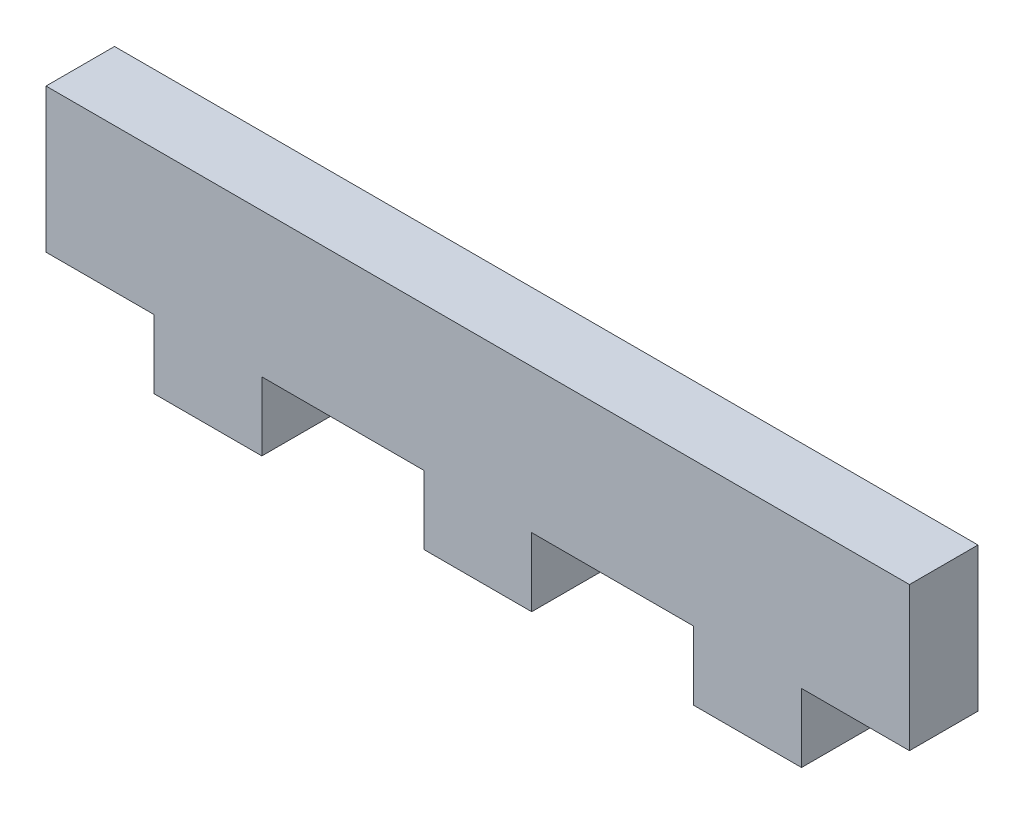
ISO-10303-21;
HEADER;
FILE_DESCRIPTION(('STEP AP214'),'2;1');
FILE_NAME('part.step','',(''),(''),'','','');
FILE_SCHEMA(('AUTOMOTIVE_DESIGN { 1 0 10303 214 1 1 1 1 }'));
ENDSEC;
DATA;
#1=APPLICATION_CONTEXT('core data for automotive mechanical design processes');
#2=APPLICATION_PROTOCOL_DEFINITION('international standard','automotive_design',2000,#1);
#3=PRODUCT_CONTEXT('',#1,'mechanical');
#4=PRODUCT('Part','Part','',(#3));
#5=PRODUCT_RELATED_PRODUCT_CATEGORY('part','',(#4));
#6=PRODUCT_DEFINITION_FORMATION('','',#4);
#7=PRODUCT_DEFINITION_CONTEXT('part definition',#1,'design');
#8=PRODUCT_DEFINITION('design','',#6,#7);
#9=PRODUCT_DEFINITION_SHAPE('','',#8);
#10=(LENGTH_UNIT() NAMED_UNIT(*) SI_UNIT(.MILLI.,.METRE.));
#11=(NAMED_UNIT(*) PLANE_ANGLE_UNIT() SI_UNIT($,.RADIAN.));
#12=(NAMED_UNIT(*) SI_UNIT($,.STERADIAN.) SOLID_ANGLE_UNIT());
#13=UNCERTAINTY_MEASURE_WITH_UNIT(LENGTH_MEASURE(1.E-05),#10,'distance_accuracy_value','');
#14=(GEOMETRIC_REPRESENTATION_CONTEXT(3) GLOBAL_UNCERTAINTY_ASSIGNED_CONTEXT((#13)) GLOBAL_UNIT_ASSIGNED_CONTEXT((#10,
#11,#12)) REPRESENTATION_CONTEXT('',''));
#15=CARTESIAN_POINT('',(0.,0.,0.));
#16=DIRECTION('',(0.,0.,1.));
#17=DIRECTION('',(1.,0.,0.));
#18=AXIS2_PLACEMENT_3D('',#15,#16,#17);
#19=CARTESIAN_POINT('',(20.,-3.33333333333333,3.175));
#20=DIRECTION('',(-1.,0.,0.));
#21=DIRECTION('',(0.,0.,1.));
#22=AXIS2_PLACEMENT_3D('',#19,#20,#21);
#23=PLANE('',#22);
#24=DIRECTION('',(0.,1.,0.));
#25=VECTOR('',#24,1.);
#26=CARTESIAN_POINT('',(20.,-3.33333333333333,0.));
#27=LINE('',#26,#25);
#28=CARTESIAN_POINT('',(20.,-3.33333333333333,0.));
#29=VERTEX_POINT('',#28);
#30=CARTESIAN_POINT('',(20.,3.33333333333333,0.));
#31=VERTEX_POINT('',#30);
#32=EDGE_CURVE('E188',#29,#31,#27,.T.);
#33=ORIENTED_EDGE('',*,*,#32,.T.);
#34=DIRECTION('',(0.,0.,-1.));
#35=VECTOR('',#34,1.);
#36=CARTESIAN_POINT('',(20.,3.33333333333333,3.175));
#37=LINE('',#36,#35);
#38=CARTESIAN_POINT('',(20.,3.33333333333333,3.175));
#39=VERTEX_POINT('',#38);
#40=EDGE_CURVE('E11',#39,#31,#37,.T.);
#41=ORIENTED_EDGE('',*,*,#40,.F.);
#42=DIRECTION('',(0.,1.,0.));
#43=VECTOR('',#42,1.);
#44=CARTESIAN_POINT('',(20.,-3.33333333333333,3.175));
#45=LINE('',#44,#43);
#46=CARTESIAN_POINT('',(20.,-3.33333333333333,3.175));
#47=VERTEX_POINT('',#46);
#48=EDGE_CURVE('E234',#47,#39,#45,.T.);
#49=ORIENTED_EDGE('',*,*,#48,.F.);
#50=DIRECTION('',(0.,0.,-1.));
#51=VECTOR('',#50,1.);
#52=CARTESIAN_POINT('',(20.,-3.33333333333333,3.175));
#53=LINE('',#52,#51);
#54=EDGE_CURVE('E184',#47,#29,#53,.T.);
#55=ORIENTED_EDGE('',*,*,#54,.T.);
#56=EDGE_LOOP('',(#33,#41,#49,#55));
#57=FACE_BOUND('',#56,.T.);
#58=ADVANCED_FACE('F39',(#57),#23,.F.);
#59=CARTESIAN_POINT('',(-20.,3.33333333333333,3.175));
#60=DIRECTION('',(0.,-1.,0.));
#61=DIRECTION('',(0.,0.,-1.));
#62=AXIS2_PLACEMENT_3D('',#59,#60,#61);
#63=PLANE('',#62);
#64=DIRECTION('',(-1.,0.,0.));
#65=VECTOR('',#64,1.);
#66=CARTESIAN_POINT('',(-20.,3.33333333333333,0.));
#67=LINE('',#66,#65);
#68=CARTESIAN_POINT('',(-20.,3.33333333333333,0.));
#69=VERTEX_POINT('',#68);
#70=EDGE_CURVE('E192',#31,#69,#67,.T.);
#71=ORIENTED_EDGE('',*,*,#70,.T.);
#72=DIRECTION('',(0.,0.,-1.));
#73=VECTOR('',#72,1.);
#74=CARTESIAN_POINT('',(-20.,3.33333333333333,3.175));
#75=LINE('',#74,#73);
#76=CARTESIAN_POINT('',(-20.,3.33333333333333,3.175));
#77=VERTEX_POINT('',#76);
#78=EDGE_CURVE('E48',#77,#69,#75,.T.);
#79=ORIENTED_EDGE('',*,*,#78,.F.);
#80=DIRECTION('',(-1.,0.,0.));
#81=VECTOR('',#80,1.);
#82=CARTESIAN_POINT('',(-20.,3.33333333333333,3.175));
#83=LINE('',#82,#81);
#84=EDGE_CURVE('E123',#39,#77,#83,.T.);
#85=ORIENTED_EDGE('',*,*,#84,.F.);
#86=ORIENTED_EDGE('',*,*,#40,.T.);
#87=EDGE_LOOP('',(#71,#79,#85,#86));
#88=FACE_BOUND('',#87,.T.);
#89=ADVANCED_FACE('F356',(#88),#63,.F.);
#90=CARTESIAN_POINT('',(-20.,-3.33333333333333,3.175));
#91=DIRECTION('',(1.,0.,0.));
#92=DIRECTION('',(0.,0.,-1.));
#93=AXIS2_PLACEMENT_3D('',#90,#91,#92);
#94=PLANE('',#93);
#95=DIRECTION('',(0.,-1.,0.));
#96=VECTOR('',#95,1.);
#97=CARTESIAN_POINT('',(-20.,-3.33333333333333,0.));
#98=LINE('',#97,#96);
#99=CARTESIAN_POINT('',(-20.,-3.33333333333333,0.));
#100=VERTEX_POINT('',#99);
#101=EDGE_CURVE('E195',#69,#100,#98,.T.);
#102=ORIENTED_EDGE('',*,*,#101,.T.);
#103=DIRECTION('',(0.,0.,-1.));
#104=VECTOR('',#103,1.);
#105=CARTESIAN_POINT('',(-20.,-3.33333333333333,3.175));
#106=LINE('',#105,#104);
#107=CARTESIAN_POINT('',(-20.,-3.33333333333333,3.175));
#108=VERTEX_POINT('',#107);
#109=EDGE_CURVE('E277',#108,#100,#106,.T.);
#110=ORIENTED_EDGE('',*,*,#109,.F.);
#111=DIRECTION('',(0.,-1.,0.));
#112=VECTOR('',#111,1.);
#113=CARTESIAN_POINT('',(-20.,-3.33333333333333,3.175));
#114=LINE('',#113,#112);
#115=EDGE_CURVE('E287',#77,#108,#114,.T.);
#116=ORIENTED_EDGE('',*,*,#115,.F.);
#117=ORIENTED_EDGE('',*,*,#78,.T.);
#118=EDGE_LOOP('',(#102,#110,#116,#117));
#119=FACE_BOUND('',#118,.T.);
#120=ADVANCED_FACE('F285',(#119),#94,.F.);
#121=CARTESIAN_POINT('',(-20.,-3.33333333333333,3.175));
#122=DIRECTION('',(0.,1.,0.));
#123=DIRECTION('',(-1.,0.,0.));
#124=AXIS2_PLACEMENT_3D('',#121,#122,#123);
#125=PLANE('',#124);
#126=DIRECTION('',(1.,0.,0.));
#127=VECTOR('',#126,1.);
#128=CARTESIAN_POINT('',(-20.,-3.33333333333333,0.));
#129=LINE('',#128,#127);
#130=CARTESIAN_POINT('',(-15.,-3.33333333333333,0.));
#131=VERTEX_POINT('',#130);
#132=EDGE_CURVE('E198',#100,#131,#129,.T.);
#133=ORIENTED_EDGE('',*,*,#132,.T.);
#134=DIRECTION('',(0.,0.,-1.));
#135=VECTOR('',#134,1.);
#136=CARTESIAN_POINT('',(-15.,-3.33333333333333,3.175));
#137=LINE('',#136,#135);
#138=CARTESIAN_POINT('',(-15.,-3.33333333333333,3.175));
#139=VERTEX_POINT('',#138);
#140=EDGE_CURVE('E273',#139,#131,#137,.T.);
#141=ORIENTED_EDGE('',*,*,#140,.F.);
#142=DIRECTION('',(1.,0.,0.));
#143=VECTOR('',#142,1.);
#144=CARTESIAN_POINT('',(-20.,-3.33333333333333,3.175));
#145=LINE('',#144,#143);
#146=EDGE_CURVE('E306',#108,#139,#145,.T.);
#147=ORIENTED_EDGE('',*,*,#146,.F.);
#148=ORIENTED_EDGE('',*,*,#109,.T.);
#149=EDGE_LOOP('',(#133,#141,#147,#148));
#150=FACE_BOUND('',#149,.T.);
#151=ADVANCED_FACE('F296',(#150),#125,.F.);
#152=CARTESIAN_POINT('',(-15.,-3.33333333333333,3.175));
#153=DIRECTION('',(1.,0.,0.));
#154=DIRECTION('',(0.,0.,-1.));
#155=AXIS2_PLACEMENT_3D('',#152,#153,#154);
#156=PLANE('',#155);
#157=DIRECTION('',(0.,-1.,0.));
#158=VECTOR('',#157,1.);
#159=CARTESIAN_POINT('',(-15.,-3.33333333333333,0.));
#160=LINE('',#159,#158);
#161=CARTESIAN_POINT('',(-15.,-6.50833333333333,0.));
#162=VERTEX_POINT('',#161);
#163=EDGE_CURVE('E201',#131,#162,#160,.T.);
#164=ORIENTED_EDGE('',*,*,#163,.T.);
#165=DIRECTION('',(0.,0.,-1.));
#166=VECTOR('',#165,1.);
#167=CARTESIAN_POINT('',(-15.,-6.50833333333333,3.175));
#168=LINE('',#167,#166);
#169=CARTESIAN_POINT('',(-15.,-6.50833333333333,3.175));
#170=VERTEX_POINT('',#169);
#171=EDGE_CURVE('E269',#170,#162,#168,.T.);
#172=ORIENTED_EDGE('',*,*,#171,.F.);
#173=DIRECTION('',(0.,-1.,0.));
#174=VECTOR('',#173,1.);
#175=CARTESIAN_POINT('',(-15.,-3.33333333333333,3.175));
#176=LINE('',#175,#174);
#177=EDGE_CURVE('E302',#139,#170,#176,.T.);
#178=ORIENTED_EDGE('',*,*,#177,.F.);
#179=ORIENTED_EDGE('',*,*,#140,.T.);
#180=EDGE_LOOP('',(#164,#172,#178,#179));
#181=FACE_BOUND('',#180,.T.);
#182=ADVANCED_FACE('F300',(#181),#156,.F.);
#183=CARTESIAN_POINT('',(-15.,-6.50833333333333,3.175));
#184=DIRECTION('',(0.,1.,0.));
#185=DIRECTION('',(-1.,0.,0.));
#186=AXIS2_PLACEMENT_3D('',#183,#184,#185);
#187=PLANE('',#186);
#188=DIRECTION('',(1.,0.,0.));
#189=VECTOR('',#188,1.);
#190=CARTESIAN_POINT('',(-15.,-6.50833333333333,0.));
#191=LINE('',#190,#189);
#192=CARTESIAN_POINT('',(-9.99999999999999,-6.50833333333333,0.));
#193=VERTEX_POINT('',#192);
#194=EDGE_CURVE('E204',#162,#193,#191,.T.);
#195=ORIENTED_EDGE('',*,*,#194,.T.);
#196=DIRECTION('',(0.,0.,-1.));
#197=VECTOR('',#196,1.);
#198=CARTESIAN_POINT('',(-9.99999999999999,-6.50833333333333,3.175));
#199=LINE('',#198,#197);
#200=CARTESIAN_POINT('',(-9.99999999999999,-6.50833333333333,3.175));
#201=VERTEX_POINT('',#200);
#202=EDGE_CURVE('E265',#201,#193,#199,.T.);
#203=ORIENTED_EDGE('',*,*,#202,.F.);
#204=DIRECTION('',(1.,0.,0.));
#205=VECTOR('',#204,1.);
#206=CARTESIAN_POINT('',(-15.,-6.50833333333333,3.175));
#207=LINE('',#206,#205);
#208=EDGE_CURVE('E305',#170,#201,#207,.T.);
#209=ORIENTED_EDGE('',*,*,#208,.F.);
#210=ORIENTED_EDGE('',*,*,#171,.T.);
#211=EDGE_LOOP('',(#195,#203,#209,#210));
#212=FACE_BOUND('',#211,.T.);
#213=ADVANCED_FACE('F369',(#212),#187,.F.);
#214=CARTESIAN_POINT('',(-9.99999999999999,-3.33333333333333,3.175));
#215=DIRECTION('',(-1.,0.,0.));
#216=DIRECTION('',(0.,0.,1.));
#217=AXIS2_PLACEMENT_3D('',#214,#215,#216);
#218=PLANE('',#217);
#219=DIRECTION('',(0.,1.,0.));
#220=VECTOR('',#219,1.);
#221=CARTESIAN_POINT('',(-9.99999999999999,-3.33333333333333,0.));
#222=LINE('',#221,#220);
#223=CARTESIAN_POINT('',(-9.99999999999999,-3.33333333333333,0.));
#224=VERTEX_POINT('',#223);
#225=EDGE_CURVE('E207',#193,#224,#222,.T.);
#226=ORIENTED_EDGE('',*,*,#225,.T.);
#227=DIRECTION('',(0.,0.,-1.));
#228=VECTOR('',#227,1.);
#229=CARTESIAN_POINT('',(-9.99999999999999,-3.33333333333333,3.175));
#230=LINE('',#229,#228);
#231=CARTESIAN_POINT('',(-9.99999999999999,-3.33333333333333,3.175));
#232=VERTEX_POINT('',#231);
#233=EDGE_CURVE('E261',#232,#224,#230,.T.);
#234=ORIENTED_EDGE('',*,*,#233,.F.);
#235=DIRECTION('',(0.,1.,0.));
#236=VECTOR('',#235,1.);
#237=CARTESIAN_POINT('',(-9.99999999999999,-3.33333333333333,3.175));
#238=LINE('',#237,#236);
#239=EDGE_CURVE('E310',#201,#232,#238,.T.);
#240=ORIENTED_EDGE('',*,*,#239,.F.);
#241=ORIENTED_EDGE('',*,*,#202,.T.);
#242=EDGE_LOOP('',(#226,#234,#240,#241));
#243=FACE_BOUND('',#242,.T.);
#244=ADVANCED_FACE('F372',(#243),#218,.F.);
#245=CARTESIAN_POINT('',(-9.99999999999999,-3.33333333333333,3.175));
#246=DIRECTION('',(0.,1.,0.));
#247=DIRECTION('',(0.,0.,1.));
#248=AXIS2_PLACEMENT_3D('',#245,#246,#247);
#249=PLANE('',#248);
#250=DIRECTION('',(1.,0.,0.));
#251=VECTOR('',#250,1.);
#252=CARTESIAN_POINT('',(-9.99999999999999,-3.33333333333333,0.));
#253=LINE('',#252,#251);
#254=CARTESIAN_POINT('',(-2.49999999999999,-3.33333333333333,0.));
#255=VERTEX_POINT('',#254);
#256=EDGE_CURVE('E210',#224,#255,#253,.T.);
#257=ORIENTED_EDGE('',*,*,#256,.T.);
#258=DIRECTION('',(0.,0.,-1.));
#259=VECTOR('',#258,1.);
#260=CARTESIAN_POINT('',(-2.49999999999999,-3.33333333333333,3.175));
#261=LINE('',#260,#259);
#262=CARTESIAN_POINT('',(-2.49999999999999,-3.33333333333333,3.175));
#263=VERTEX_POINT('',#262);
#264=EDGE_CURVE('E257',#263,#255,#261,.T.);
#265=ORIENTED_EDGE('',*,*,#264,.F.);
#266=DIRECTION('',(1.,0.,0.));
#267=VECTOR('',#266,1.);
#268=CARTESIAN_POINT('',(-9.99999999999999,-3.33333333333333,3.175));
#269=LINE('',#268,#267);
#270=EDGE_CURVE('E317',#232,#263,#269,.T.);
#271=ORIENTED_EDGE('',*,*,#270,.F.);
#272=ORIENTED_EDGE('',*,*,#233,.T.);
#273=EDGE_LOOP('',(#257,#265,#271,#272));
#274=FACE_BOUND('',#273,.T.);
#275=ADVANCED_FACE('F376',(#274),#249,.F.);
#276=CARTESIAN_POINT('',(-2.49999999999999,-3.33333333333333,3.175));
#277=DIRECTION('',(1.,0.,0.));
#278=DIRECTION('',(0.,1.,0.));
#279=AXIS2_PLACEMENT_3D('',#276,#277,#278);
#280=PLANE('',#279);
#281=DIRECTION('',(0.,-1.,0.));
#282=VECTOR('',#281,1.);
#283=CARTESIAN_POINT('',(-2.49999999999999,-3.33333333333333,0.));
#284=LINE('',#283,#282);
#285=CARTESIAN_POINT('',(-2.49999999999999,-6.50833333333333,0.));
#286=VERTEX_POINT('',#285);
#287=EDGE_CURVE('E213',#255,#286,#284,.T.);
#288=ORIENTED_EDGE('',*,*,#287,.T.);
#289=DIRECTION('',(0.,0.,-1.));
#290=VECTOR('',#289,1.);
#291=CARTESIAN_POINT('',(-2.49999999999999,-6.50833333333333,3.175));
#292=LINE('',#291,#290);
#293=CARTESIAN_POINT('',(-2.49999999999999,-6.50833333333333,3.175));
#294=VERTEX_POINT('',#293);
#295=EDGE_CURVE('E253',#294,#286,#292,.T.);
#296=ORIENTED_EDGE('',*,*,#295,.F.);
#297=DIRECTION('',(0.,-1.,0.));
#298=VECTOR('',#297,1.);
#299=CARTESIAN_POINT('',(-2.49999999999999,-3.33333333333333,3.175));
#300=LINE('',#299,#298);
#301=EDGE_CURVE('E320',#263,#294,#300,.T.);
#302=ORIENTED_EDGE('',*,*,#301,.F.);
#303=ORIENTED_EDGE('',*,*,#264,.T.);
#304=EDGE_LOOP('',(#288,#296,#302,#303));
#305=FACE_BOUND('',#304,.T.);
#306=ADVANCED_FACE('F380',(#305),#280,.F.);
#307=CARTESIAN_POINT('',(-2.49999999999999,-6.50833333333333,3.175));
#308=DIRECTION('',(0.,1.,0.));
#309=DIRECTION('',(-1.,0.,0.));
#310=AXIS2_PLACEMENT_3D('',#307,#308,#309);
#311=PLANE('',#310);
#312=DIRECTION('',(1.,0.,0.));
#313=VECTOR('',#312,1.);
#314=CARTESIAN_POINT('',(-2.49999999999999,-6.50833333333333,0.));
#315=LINE('',#314,#313);
#316=CARTESIAN_POINT('',(2.50000000000001,-6.50833333333333,0.));
#317=VERTEX_POINT('',#316);
#318=EDGE_CURVE('E216',#286,#317,#315,.T.);
#319=ORIENTED_EDGE('',*,*,#318,.T.);
#320=DIRECTION('',(0.,0.,-1.));
#321=VECTOR('',#320,1.);
#322=CARTESIAN_POINT('',(2.50000000000001,-6.50833333333333,3.175));
#323=LINE('',#322,#321);
#324=CARTESIAN_POINT('',(2.50000000000001,-6.50833333333333,3.175));
#325=VERTEX_POINT('',#324);
#326=EDGE_CURVE('E249',#325,#317,#323,.T.);
#327=ORIENTED_EDGE('',*,*,#326,.F.);
#328=DIRECTION('',(1.,0.,0.));
#329=VECTOR('',#328,1.);
#330=CARTESIAN_POINT('',(-2.49999999999999,-6.50833333333333,3.175));
#331=LINE('',#330,#329);
#332=EDGE_CURVE('E323',#294,#325,#331,.T.);
#333=ORIENTED_EDGE('',*,*,#332,.F.);
#334=ORIENTED_EDGE('',*,*,#295,.T.);
#335=EDGE_LOOP('',(#319,#327,#333,#334));
#336=FACE_BOUND('',#335,.T.);
#337=ADVANCED_FACE('F384',(#336),#311,.F.);
#338=CARTESIAN_POINT('',(2.50000000000001,-3.33333333333333,3.175));
#339=DIRECTION('',(-1.,0.,0.));
#340=DIRECTION('',(0.,-1.,0.));
#341=AXIS2_PLACEMENT_3D('',#338,#339,#340);
#342=PLANE('',#341);
#343=DIRECTION('',(0.,1.,0.));
#344=VECTOR('',#343,1.);
#345=CARTESIAN_POINT('',(2.50000000000001,-3.33333333333333,0.));
#346=LINE('',#345,#344);
#347=CARTESIAN_POINT('',(2.50000000000001,-3.33333333333333,0.));
#348=VERTEX_POINT('',#347);
#349=EDGE_CURVE('E219',#317,#348,#346,.T.);
#350=ORIENTED_EDGE('',*,*,#349,.T.);
#351=DIRECTION('',(0.,0.,-1.));
#352=VECTOR('',#351,1.);
#353=CARTESIAN_POINT('',(2.50000000000001,-3.33333333333333,3.175));
#354=LINE('',#353,#352);
#355=CARTESIAN_POINT('',(2.50000000000001,-3.33333333333333,3.175));
#356=VERTEX_POINT('',#355);
#357=EDGE_CURVE('E245',#356,#348,#354,.T.);
#358=ORIENTED_EDGE('',*,*,#357,.F.);
#359=DIRECTION('',(0.,1.,0.));
#360=VECTOR('',#359,1.);
#361=CARTESIAN_POINT('',(2.50000000000001,-3.33333333333333,3.175));
#362=LINE('',#361,#360);
#363=EDGE_CURVE('E326',#325,#356,#362,.T.);
#364=ORIENTED_EDGE('',*,*,#363,.F.);
#365=ORIENTED_EDGE('',*,*,#326,.T.);
#366=EDGE_LOOP('',(#350,#358,#364,#365));
#367=FACE_BOUND('',#366,.T.);
#368=ADVANCED_FACE('F388',(#367),#342,.F.);
#369=CARTESIAN_POINT('',(2.50000000000001,-3.33333333333333,3.175));
#370=DIRECTION('',(0.,1.,0.));
#371=DIRECTION('',(-1.,0.,0.));
#372=AXIS2_PLACEMENT_3D('',#369,#370,#371);
#373=PLANE('',#372);
#374=DIRECTION('',(1.,0.,0.));
#375=VECTOR('',#374,1.);
#376=CARTESIAN_POINT('',(2.50000000000001,-3.33333333333333,0.));
#377=LINE('',#376,#375);
#378=CARTESIAN_POINT('',(10.,-3.33333333333333,0.));
#379=VERTEX_POINT('',#378);
#380=EDGE_CURVE('E222',#348,#379,#377,.T.);
#381=ORIENTED_EDGE('',*,*,#380,.T.);
#382=DIRECTION('',(0.,0.,-1.));
#383=VECTOR('',#382,1.);
#384=CARTESIAN_POINT('',(10.,-3.33333333333333,3.175));
#385=LINE('',#384,#383);
#386=CARTESIAN_POINT('',(10.,-3.33333333333333,3.175));
#387=VERTEX_POINT('',#386);
#388=EDGE_CURVE('E241',#387,#379,#385,.T.);
#389=ORIENTED_EDGE('',*,*,#388,.F.);
#390=DIRECTION('',(1.,0.,0.));
#391=VECTOR('',#390,1.);
#392=CARTESIAN_POINT('',(2.50000000000001,-3.33333333333333,3.175));
#393=LINE('',#392,#391);
#394=EDGE_CURVE('E329',#356,#387,#393,.T.);
#395=ORIENTED_EDGE('',*,*,#394,.F.);
#396=ORIENTED_EDGE('',*,*,#357,.T.);
#397=EDGE_LOOP('',(#381,#389,#395,#396));
#398=FACE_BOUND('',#397,.T.);
#399=ADVANCED_FACE('F337',(#398),#373,.F.);
#400=CARTESIAN_POINT('',(10.,-3.33333333333333,3.175));
#401=DIRECTION('',(1.,0.,0.));
#402=DIRECTION('',(0.,0.,-1.));
#403=AXIS2_PLACEMENT_3D('',#400,#401,#402);
#404=PLANE('',#403);
#405=DIRECTION('',(0.,-1.,0.));
#406=VECTOR('',#405,1.);
#407=CARTESIAN_POINT('',(10.,-3.33333333333333,0.));
#408=LINE('',#407,#406);
#409=CARTESIAN_POINT('',(10.,-6.50833333333333,0.));
#410=VERTEX_POINT('',#409);
#411=EDGE_CURVE('E225',#379,#410,#408,.T.);
#412=ORIENTED_EDGE('',*,*,#411,.T.);
#413=DIRECTION('',(0.,0.,-1.));
#414=VECTOR('',#413,1.);
#415=CARTESIAN_POINT('',(10.,-6.50833333333333,3.175));
#416=LINE('',#415,#414);
#417=CARTESIAN_POINT('',(10.,-6.50833333333333,3.175));
#418=VERTEX_POINT('',#417);
#419=EDGE_CURVE('E177',#418,#410,#416,.T.);
#420=ORIENTED_EDGE('',*,*,#419,.F.);
#421=DIRECTION('',(0.,-1.,0.));
#422=VECTOR('',#421,1.);
#423=CARTESIAN_POINT('',(10.,-3.33333333333333,3.175));
#424=LINE('',#423,#422);
#425=EDGE_CURVE('E166',#387,#418,#424,.T.);
#426=ORIENTED_EDGE('',*,*,#425,.F.);
#427=ORIENTED_EDGE('',*,*,#388,.T.);
#428=EDGE_LOOP('',(#412,#420,#426,#427));
#429=FACE_BOUND('',#428,.T.);
#430=ADVANCED_FACE('F341',(#429),#404,.F.);
#431=CARTESIAN_POINT('',(10.,-6.50833333333333,3.175));
#432=DIRECTION('',(0.,1.,0.));
#433=DIRECTION('',(-1.,0.,0.));
#434=AXIS2_PLACEMENT_3D('',#431,#432,#433);
#435=PLANE('',#434);
#436=DIRECTION('',(1.,0.,0.));
#437=VECTOR('',#436,1.);
#438=CARTESIAN_POINT('',(10.,-6.50833333333333,0.));
#439=LINE('',#438,#437);
#440=CARTESIAN_POINT('',(15.,-6.50833333333333,0.));
#441=VERTEX_POINT('',#440);
#442=EDGE_CURVE('E175',#410,#441,#439,.T.);
#443=ORIENTED_EDGE('',*,*,#442,.T.);
#444=DIRECTION('',(0.,0.,-1.));
#445=VECTOR('',#444,1.);
#446=CARTESIAN_POINT('',(15.,-6.50833333333333,3.175));
#447=LINE('',#446,#445);
#448=CARTESIAN_POINT('',(15.,-6.50833333333333,3.175));
#449=VERTEX_POINT('',#448);
#450=EDGE_CURVE('E172',#449,#441,#447,.T.);
#451=ORIENTED_EDGE('',*,*,#450,.F.);
#452=DIRECTION('',(1.,0.,0.));
#453=VECTOR('',#452,1.);
#454=CARTESIAN_POINT('',(10.,-6.50833333333333,3.175));
#455=LINE('',#454,#453);
#456=EDGE_CURVE('E160',#418,#449,#455,.T.);
#457=ORIENTED_EDGE('',*,*,#456,.F.);
#458=ORIENTED_EDGE('',*,*,#419,.T.);
#459=EDGE_LOOP('',(#443,#451,#457,#458));
#460=FACE_BOUND('',#459,.T.);
#461=ADVANCED_FACE('F173',(#460),#435,.F.);
#462=CARTESIAN_POINT('',(15.,-3.33333333333333,3.175));
#463=DIRECTION('',(-1.,0.,0.));
#464=DIRECTION('',(0.,0.,1.));
#465=AXIS2_PLACEMENT_3D('',#462,#463,#464);
#466=PLANE('',#465);
#467=DIRECTION('',(0.,1.,0.));
#468=VECTOR('',#467,1.);
#469=CARTESIAN_POINT('',(15.,-3.33333333333333,0.));
#470=LINE('',#469,#468);
#471=CARTESIAN_POINT('',(15.,-3.33333333333333,0.));
#472=VERTEX_POINT('',#471);
#473=EDGE_CURVE('E109',#441,#472,#470,.T.);
#474=ORIENTED_EDGE('',*,*,#473,.T.);
#475=DIRECTION('',(0.,0.,-1.));
#476=VECTOR('',#475,1.);
#477=CARTESIAN_POINT('',(15.,-3.33333333333333,3.175));
#478=LINE('',#477,#476);
#479=CARTESIAN_POINT('',(15.,-3.33333333333333,3.175));
#480=VERTEX_POINT('',#479);
#481=EDGE_CURVE('E178',#480,#472,#478,.T.);
#482=ORIENTED_EDGE('',*,*,#481,.F.);
#483=DIRECTION('',(0.,1.,0.));
#484=VECTOR('',#483,1.);
#485=CARTESIAN_POINT('',(15.,-3.33333333333333,3.175));
#486=LINE('',#485,#484);
#487=EDGE_CURVE('E164',#449,#480,#486,.T.);
#488=ORIENTED_EDGE('',*,*,#487,.F.);
#489=ORIENTED_EDGE('',*,*,#450,.T.);
#490=EDGE_LOOP('',(#474,#482,#488,#489));
#491=FACE_BOUND('',#490,.T.);
#492=ADVANCED_FACE('F180',(#491),#466,.F.);
#493=CARTESIAN_POINT('',(15.,-3.33333333333333,3.175));
#494=DIRECTION('',(0.,1.,0.));
#495=DIRECTION('',(-1.,0.,0.));
#496=AXIS2_PLACEMENT_3D('',#493,#494,#495);
#497=PLANE('',#496);
#498=DIRECTION('',(1.,0.,0.));
#499=VECTOR('',#498,1.);
#500=CARTESIAN_POINT('',(15.,-3.33333333333333,0.));
#501=LINE('',#500,#499);
#502=EDGE_CURVE('E115',#472,#29,#501,.T.);
#503=ORIENTED_EDGE('',*,*,#502,.T.);
#504=ORIENTED_EDGE('',*,*,#54,.F.);
#505=DIRECTION('',(1.,0.,0.));
#506=VECTOR('',#505,1.);
#507=CARTESIAN_POINT('',(15.,-3.33333333333333,3.175));
#508=LINE('',#507,#506);
#509=EDGE_CURVE('E56',#480,#47,#508,.T.);
#510=ORIENTED_EDGE('',*,*,#509,.F.);
#511=ORIENTED_EDGE('',*,*,#481,.T.);
#512=EDGE_LOOP('',(#503,#504,#510,#511));
#513=FACE_BOUND('',#512,.T.);
#514=ADVANCED_FACE('F345',(#513),#497,.F.);
#515=CARTESIAN_POINT('',(0.,0.,3.175));
#516=DIRECTION('',(0.,0.,-1.));
#517=DIRECTION('',(-1.,0.,0.));
#518=AXIS2_PLACEMENT_3D('',#515,#516,#517);
#519=PLANE('',#518);
#520=ORIENTED_EDGE('',*,*,#48,.T.);
#521=ORIENTED_EDGE('',*,*,#84,.T.);
#522=ORIENTED_EDGE('',*,*,#115,.T.);
#523=ORIENTED_EDGE('',*,*,#146,.T.);
#524=ORIENTED_EDGE('',*,*,#177,.T.);
#525=ORIENTED_EDGE('',*,*,#208,.T.);
#526=ORIENTED_EDGE('',*,*,#239,.T.);
#527=ORIENTED_EDGE('',*,*,#270,.T.);
#528=ORIENTED_EDGE('',*,*,#301,.T.);
#529=ORIENTED_EDGE('',*,*,#332,.T.);
#530=ORIENTED_EDGE('',*,*,#363,.T.);
#531=ORIENTED_EDGE('',*,*,#394,.T.);
#532=ORIENTED_EDGE('',*,*,#425,.T.);
#533=ORIENTED_EDGE('',*,*,#456,.T.);
#534=ORIENTED_EDGE('',*,*,#487,.T.);
#535=ORIENTED_EDGE('',*,*,#509,.T.);
#536=EDGE_LOOP('',(#520,#521,#522,#523,#524,#525,#526,#527,#528,#529,#530,#531,#532,#533,#534,#535));
#537=FACE_BOUND('',#536,.T.);
#538=ADVANCED_FACE('F162',(#537),#519,.F.);
#539=CARTESIAN_POINT('',(0.,0.,0.));
#540=DIRECTION('',(0.,0.,-1.));
#541=DIRECTION('',(-1.,0.,0.));
#542=AXIS2_PLACEMENT_3D('',#539,#540,#541);
#543=PLANE('',#542);
#544=ORIENTED_EDGE('',*,*,#32,.F.);
#545=ORIENTED_EDGE('',*,*,#502,.F.);
#546=ORIENTED_EDGE('',*,*,#473,.F.);
#547=ORIENTED_EDGE('',*,*,#442,.F.);
#548=ORIENTED_EDGE('',*,*,#411,.F.);
#549=ORIENTED_EDGE('',*,*,#380,.F.);
#550=ORIENTED_EDGE('',*,*,#349,.F.);
#551=ORIENTED_EDGE('',*,*,#318,.F.);
#552=ORIENTED_EDGE('',*,*,#287,.F.);
#553=ORIENTED_EDGE('',*,*,#256,.F.);
#554=ORIENTED_EDGE('',*,*,#225,.F.);
#555=ORIENTED_EDGE('',*,*,#194,.F.);
#556=ORIENTED_EDGE('',*,*,#163,.F.);
#557=ORIENTED_EDGE('',*,*,#132,.F.);
#558=ORIENTED_EDGE('',*,*,#101,.F.);
#559=ORIENTED_EDGE('',*,*,#70,.F.);
#560=EDGE_LOOP('',(#544,#545,#546,#547,#548,#549,#550,#551,#552,#553,#554,#555,#556,#557,#558,#559));
#561=FACE_BOUND('',#560,.T.);
#562=ADVANCED_FACE('F291',(#561),#543,.T.);
#563=CLOSED_SHELL('',(#58,#89,#120,#151,#182,#213,#244,#275,#306,#337,#368,#399,#430,#461,#492,
#514,#538,#562));
#564=MANIFOLD_SOLID_BREP('B2',#563);
#565=ADVANCED_BREP_SHAPE_REPRESENTATION('',(#18,#564),#14);
#566=SHAPE_DEFINITION_REPRESENTATION(#9,#565);
ENDSEC;
END-ISO-10303-21;
